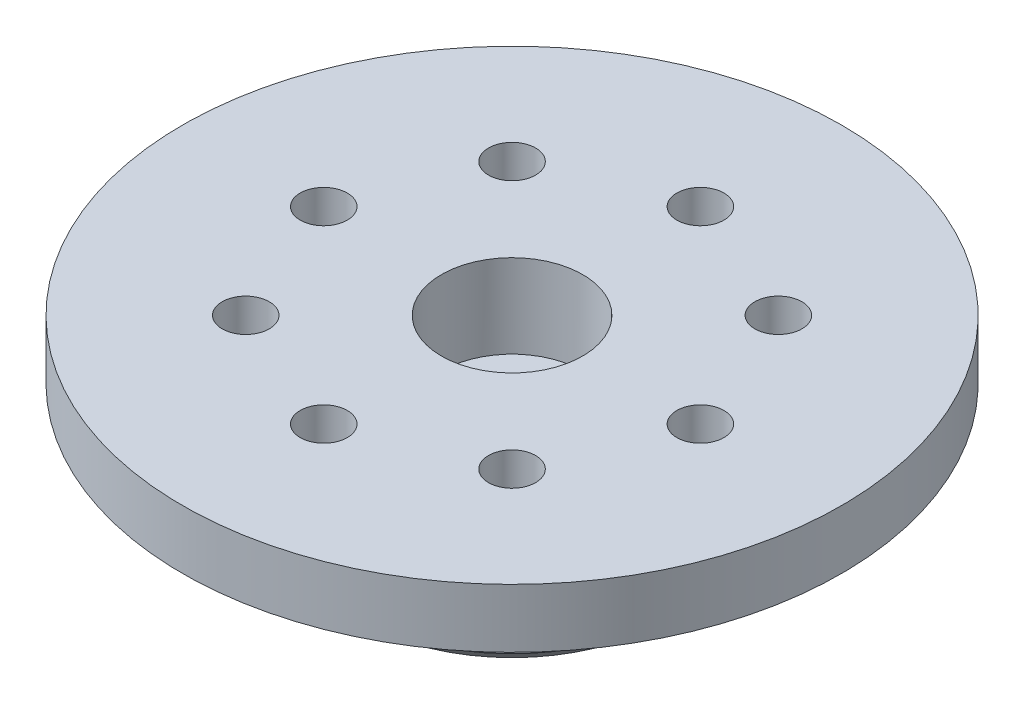
ISO-10303-21;
HEADER;
FILE_DESCRIPTION(('STEP AP214'),'2;1');
FILE_NAME('part.step','',(''),(''),'','','');
FILE_SCHEMA(('AUTOMOTIVE_DESIGN { 1 0 10303 214 1 1 1 1 }'));
ENDSEC;
DATA;
#1=APPLICATION_CONTEXT('core data for automotive mechanical design processes');
#2=APPLICATION_PROTOCOL_DEFINITION('international standard','automotive_design',2000,#1);
#3=PRODUCT_CONTEXT('',#1,'mechanical');
#4=PRODUCT('Part','Part','',(#3));
#5=PRODUCT_RELATED_PRODUCT_CATEGORY('part','',(#4));
#6=PRODUCT_DEFINITION_FORMATION('','',#4);
#7=PRODUCT_DEFINITION_CONTEXT('part definition',#1,'design');
#8=PRODUCT_DEFINITION('design','',#6,#7);
#9=PRODUCT_DEFINITION_SHAPE('','',#8);
#10=(LENGTH_UNIT() NAMED_UNIT(*) SI_UNIT(.MILLI.,.METRE.));
#11=(NAMED_UNIT(*) PLANE_ANGLE_UNIT() SI_UNIT($,.RADIAN.));
#12=(NAMED_UNIT(*) SI_UNIT($,.STERADIAN.) SOLID_ANGLE_UNIT());
#13=UNCERTAINTY_MEASURE_WITH_UNIT(LENGTH_MEASURE(1.E-05),#10,'distance_accuracy_value','');
#14=(GEOMETRIC_REPRESENTATION_CONTEXT(3) GLOBAL_UNCERTAINTY_ASSIGNED_CONTEXT((#13)) GLOBAL_UNIT_ASSIGNED_CONTEXT((#10,
#11,#12)) REPRESENTATION_CONTEXT('',''));
#15=CARTESIAN_POINT('',(0.,0.,0.));
#16=DIRECTION('',(0.,0.,1.));
#17=DIRECTION('',(1.,0.,0.));
#18=AXIS2_PLACEMENT_3D('',#15,#16,#17);
#19=CARTESIAN_POINT('',(0.,-2.5,0.));
#20=DIRECTION('',(0.,-1.,0.));
#21=DIRECTION('',(0.,0.,-1.));
#22=AXIS2_PLACEMENT_3D('',#19,#20,#21);
#23=PLANE('',#22);
#24=CARTESIAN_POINT('',(5.65685424949258,-2.5,-5.65685424949286));
#25=DIRECTION('',(0.,-1.,0.));
#26=DIRECTION('',(0.,0.,-1.));
#27=AXIS2_PLACEMENT_3D('',#24,#25,#26);
#28=CIRCLE('',#27,1.);
#29=CARTESIAN_POINT('',(5.65685424949258,-2.5,-6.65685424949286));
#30=VERTEX_POINT('',#29);
#31=EDGE_CURVE('E76',#30,#30,#28,.T.);
#32=ORIENTED_EDGE('',*,*,#31,.F.);
#33=EDGE_LOOP('',(#32));
#34=FACE_BOUND('',#33,.T.);
#35=CARTESIAN_POINT('',(8.00000000000068,-2.5,-6.81141308890378E-13));
#36=DIRECTION('',(0.,-1.,0.));
#37=DIRECTION('',(0.,0.,-1.));
#38=AXIS2_PLACEMENT_3D('',#35,#36,#37);
#39=CIRCLE('',#38,1.);
#40=CARTESIAN_POINT('',(8.00000000000068,-2.5,-1.00000000000068));
#41=VERTEX_POINT('',#40);
#42=EDGE_CURVE('E72',#41,#41,#39,.T.);
#43=ORIENTED_EDGE('',*,*,#42,.F.);
#44=EDGE_LOOP('',(#43));
#45=FACE_BOUND('',#44,.T.);
#46=CARTESIAN_POINT('',(5.65685424949354,-2.5,5.6568542494919));
#47=DIRECTION('',(0.,-1.,0.));
#48=DIRECTION('',(0.,0.,-1.));
#49=AXIS2_PLACEMENT_3D('',#46,#47,#48);
#50=CIRCLE('',#49,1.);
#51=CARTESIAN_POINT('',(5.65685424949354,-2.5,4.6568542494919));
#52=VERTEX_POINT('',#51);
#53=EDGE_CURVE('E68',#52,#52,#50,.T.);
#54=ORIENTED_EDGE('',*,*,#53,.F.);
#55=EDGE_LOOP('',(#54));
#56=FACE_BOUND('',#55,.T.);
#57=CARTESIAN_POINT('',(1.36228261778076E-12,-2.5,8.));
#58=DIRECTION('',(0.,-1.,0.));
#59=DIRECTION('',(0.,0.,-1.));
#60=AXIS2_PLACEMENT_3D('',#57,#58,#59);
#61=CIRCLE('',#60,1.);
#62=CARTESIAN_POINT('',(1.36228261778076E-12,-2.5,7.));
#63=VERTEX_POINT('',#62);
#64=EDGE_CURVE('E64',#63,#63,#61,.T.);
#65=ORIENTED_EDGE('',*,*,#64,.F.);
#66=EDGE_LOOP('',(#65));
#67=FACE_BOUND('',#66,.T.);
#68=CARTESIAN_POINT('',(-5.65685424949122,-2.5,5.65685424949286));
#69=DIRECTION('',(0.,-1.,0.));
#70=DIRECTION('',(0.,0.,-1.));
#71=AXIS2_PLACEMENT_3D('',#68,#69,#70);
#72=CIRCLE('',#71,1.);
#73=CARTESIAN_POINT('',(-5.65685424949122,-2.5,4.65685424949286));
#74=VERTEX_POINT('',#73);
#75=EDGE_CURVE('E60',#74,#74,#72,.T.);
#76=ORIENTED_EDGE('',*,*,#75,.F.);
#77=EDGE_LOOP('',(#76));
#78=FACE_BOUND('',#77,.T.);
#79=CARTESIAN_POINT('',(-7.99999999999932,-2.5,6.82121026329696E-13));
#80=DIRECTION('',(0.,-1.,0.));
#81=DIRECTION('',(0.,0.,-1.));
#82=AXIS2_PLACEMENT_3D('',#79,#80,#81);
#83=CIRCLE('',#82,1.);
#84=CARTESIAN_POINT('',(-7.99999999999932,-2.5,-0.999999999999318));
#85=VERTEX_POINT('',#84);
#86=EDGE_CURVE('E56',#85,#85,#83,.T.);
#87=ORIENTED_EDGE('',*,*,#86,.F.);
#88=EDGE_LOOP('',(#87));
#89=FACE_BOUND('',#88,.T.);
#90=CARTESIAN_POINT('',(-5.65685424949218,-2.5,-5.6568542494919));
#91=DIRECTION('',(0.,-1.,0.));
#92=DIRECTION('',(0.,0.,-1.));
#93=AXIS2_PLACEMENT_3D('',#90,#91,#92);
#94=CIRCLE('',#93,1.);
#95=CARTESIAN_POINT('',(-5.65685424949218,-2.5,-6.6568542494919));
#96=VERTEX_POINT('',#95);
#97=EDGE_CURVE('E51',#96,#96,#94,.T.);
#98=ORIENTED_EDGE('',*,*,#97,.F.);
#99=EDGE_LOOP('',(#98));
#100=FACE_BOUND('',#99,.T.);
#101=CARTESIAN_POINT('',(0.,-2.5,0.));
#102=DIRECTION('',(0.,-1.,0.));
#103=DIRECTION('',(0.,0.,-1.));
#104=AXIS2_PLACEMENT_3D('',#101,#102,#103);
#105=CIRCLE('',#104,14.);
#106=CARTESIAN_POINT('',(0.,-2.5,-14.));
#107=VERTEX_POINT('',#106);
#108=EDGE_CURVE('E89',#107,#107,#105,.T.);
#109=ORIENTED_EDGE('',*,*,#108,.T.);
#110=EDGE_LOOP('',(#109));
#111=FACE_BOUND('',#110,.T.);
#112=CARTESIAN_POINT('',(0.,-2.5,-8.));
#113=DIRECTION('',(0.,-1.,0.));
#114=DIRECTION('',(0.,0.,-1.));
#115=AXIS2_PLACEMENT_3D('',#112,#113,#114);
#116=CIRCLE('',#115,1.);
#117=CARTESIAN_POINT('',(0.,-2.5,-9.));
#118=VERTEX_POINT('',#117);
#119=EDGE_CURVE('E80',#118,#118,#116,.T.);
#120=ORIENTED_EDGE('',*,*,#119,.F.);
#121=EDGE_LOOP('',(#120));
#122=FACE_BOUND('',#121,.T.);
#123=CARTESIAN_POINT('',(0.,-2.5,0.));
#124=DIRECTION('',(0.,-1.,0.));
#125=DIRECTION('',(0.,0.,-1.));
#126=AXIS2_PLACEMENT_3D('',#123,#124,#125);
#127=CIRCLE('',#126,5.8);
#128=CARTESIAN_POINT('',(0.,-2.5,-5.8));
#129=VERTEX_POINT('',#128);
#130=EDGE_CURVE('E125',#129,#129,#127,.T.);
#131=ORIENTED_EDGE('',*,*,#130,.F.);
#132=EDGE_LOOP('',(#131));
#133=FACE_BOUND('',#132,.T.);
#134=ADVANCED_FACE('F30',(#34,#45,#56,#67,#78,#89,#100,#111,#122,#133),#23,.T.);
#135=CARTESIAN_POINT('',(0.,-5.55,0.));
#136=DIRECTION('',(0.,1.,0.));
#137=DIRECTION('',(0.,0.,1.));
#138=AXIS2_PLACEMENT_3D('',#135,#136,#137);
#139=CYLINDRICAL_SURFACE('',#138,3.);
#140=CARTESIAN_POINT('',(0.,0.,0.));
#141=DIRECTION('',(0.,1.,0.));
#142=DIRECTION('',(0.,0.,1.));
#143=AXIS2_PLACEMENT_3D('',#140,#141,#142);
#144=CIRCLE('',#143,3.);
#145=CARTESIAN_POINT('',(0.,0.,3.));
#146=VERTEX_POINT('',#145);
#147=EDGE_CURVE('E95',#146,#146,#144,.T.);
#148=ORIENTED_EDGE('',*,*,#147,.T.);
#149=EDGE_LOOP('',(#148));
#150=FACE_BOUND('',#149,.T.);
#151=CARTESIAN_POINT('',(0.,-3.55,0.));
#152=DIRECTION('',(0.,-1.,0.));
#153=DIRECTION('',(0.,0.,-1.));
#154=AXIS2_PLACEMENT_3D('',#151,#152,#153);
#155=CIRCLE('',#154,3.);
#156=CARTESIAN_POINT('',(0.,-3.55,-3.));
#157=VERTEX_POINT('',#156);
#158=EDGE_CURVE('E50',#157,#157,#155,.F.);
#159=ORIENTED_EDGE('',*,*,#158,.F.);
#160=EDGE_LOOP('',(#159));
#161=FACE_BOUND('',#160,.T.);
#162=ADVANCED_FACE('F132',(#150,#161),#139,.F.);
#163=CARTESIAN_POINT('',(0.,0.,0.));
#164=DIRECTION('',(0.,-1.,0.));
#165=DIRECTION('',(0.,0.,-1.));
#166=AXIS2_PLACEMENT_3D('',#163,#164,#165);
#167=CYLINDRICAL_SURFACE('',#166,14.);
#168=CARTESIAN_POINT('',(0.,0.,0.));
#169=DIRECTION('',(0.,-1.,0.));
#170=DIRECTION('',(0.,0.,-1.));
#171=AXIS2_PLACEMENT_3D('',#168,#169,#170);
#172=CIRCLE('',#171,14.);
#173=CARTESIAN_POINT('',(0.,0.,-14.));
#174=VERTEX_POINT('',#173);
#175=EDGE_CURVE('E86',#174,#174,#172,.T.);
#176=ORIENTED_EDGE('',*,*,#175,.T.);
#177=EDGE_LOOP('',(#176));
#178=FACE_BOUND('',#177,.T.);
#179=ORIENTED_EDGE('',*,*,#108,.F.);
#180=EDGE_LOOP('',(#179));
#181=FACE_BOUND('',#180,.T.);
#182=ADVANCED_FACE('F138',(#178,#181),#167,.T.);
#183=CARTESIAN_POINT('',(14.,0.,0.));
#184=DIRECTION('',(0.,1.,0.));
#185=DIRECTION('',(0.,0.,1.));
#186=AXIS2_PLACEMENT_3D('',#183,#184,#185);
#187=PLANE('',#186);
#188=CARTESIAN_POINT('',(-5.65685424949218,0.,-5.6568542494919));
#189=DIRECTION('',(0.,1.,0.));
#190=DIRECTION('',(0.,0.,1.));
#191=AXIS2_PLACEMENT_3D('',#188,#189,#190);
#192=CIRCLE('',#191,1.);
#193=CARTESIAN_POINT('',(-5.65685424949218,0.,-4.6568542494919));
#194=VERTEX_POINT('',#193);
#195=EDGE_CURVE('E55',#194,#194,#192,.T.);
#196=ORIENTED_EDGE('',*,*,#195,.F.);
#197=EDGE_LOOP('',(#196));
#198=FACE_BOUND('',#197,.T.);
#199=CARTESIAN_POINT('',(-7.99999999999932,0.,6.82121026329696E-13));
#200=DIRECTION('',(0.,1.,0.));
#201=DIRECTION('',(0.,0.,1.));
#202=AXIS2_PLACEMENT_3D('',#199,#200,#201);
#203=CIRCLE('',#202,1.);
#204=CARTESIAN_POINT('',(-7.99999999999932,0.,1.00000000000068));
#205=VERTEX_POINT('',#204);
#206=EDGE_CURVE('E54',#205,#205,#203,.T.);
#207=ORIENTED_EDGE('',*,*,#206,.F.);
#208=EDGE_LOOP('',(#207));
#209=FACE_BOUND('',#208,.T.);
#210=CARTESIAN_POINT('',(-5.65685424949122,0.,5.65685424949286));
#211=DIRECTION('',(0.,1.,0.));
#212=DIRECTION('',(0.,0.,1.));
#213=AXIS2_PLACEMENT_3D('',#210,#211,#212);
#214=CIRCLE('',#213,1.);
#215=CARTESIAN_POINT('',(-5.65685424949122,0.,6.65685424949286));
#216=VERTEX_POINT('',#215);
#217=EDGE_CURVE('E59',#216,#216,#214,.T.);
#218=ORIENTED_EDGE('',*,*,#217,.F.);
#219=EDGE_LOOP('',(#218));
#220=FACE_BOUND('',#219,.T.);
#221=CARTESIAN_POINT('',(1.36228261778076E-12,0.,8.));
#222=DIRECTION('',(0.,1.,0.));
#223=DIRECTION('',(0.,0.,1.));
#224=AXIS2_PLACEMENT_3D('',#221,#222,#223);
#225=CIRCLE('',#224,1.);
#226=CARTESIAN_POINT('',(1.36228261778076E-12,0.,9.));
#227=VERTEX_POINT('',#226);
#228=EDGE_CURVE('E63',#227,#227,#225,.T.);
#229=ORIENTED_EDGE('',*,*,#228,.F.);
#230=EDGE_LOOP('',(#229));
#231=FACE_BOUND('',#230,.T.);
#232=CARTESIAN_POINT('',(5.65685424949354,0.,5.6568542494919));
#233=DIRECTION('',(0.,1.,0.));
#234=DIRECTION('',(0.,0.,1.));
#235=AXIS2_PLACEMENT_3D('',#232,#233,#234);
#236=CIRCLE('',#235,1.);
#237=CARTESIAN_POINT('',(5.65685424949354,0.,6.6568542494919));
#238=VERTEX_POINT('',#237);
#239=EDGE_CURVE('E67',#238,#238,#236,.T.);
#240=ORIENTED_EDGE('',*,*,#239,.F.);
#241=EDGE_LOOP('',(#240));
#242=FACE_BOUND('',#241,.T.);
#243=CARTESIAN_POINT('',(8.00000000000068,0.,-6.81141308890378E-13));
#244=DIRECTION('',(0.,1.,0.));
#245=DIRECTION('',(0.,0.,1.));
#246=AXIS2_PLACEMENT_3D('',#243,#244,#245);
#247=CIRCLE('',#246,1.);
#248=CARTESIAN_POINT('',(8.00000000000068,0.,0.99999999999932));
#249=VERTEX_POINT('',#248);
#250=EDGE_CURVE('E71',#249,#249,#247,.T.);
#251=ORIENTED_EDGE('',*,*,#250,.F.);
#252=EDGE_LOOP('',(#251));
#253=FACE_BOUND('',#252,.T.);
#254=CARTESIAN_POINT('',(5.65685424949258,0.,-5.65685424949286));
#255=DIRECTION('',(0.,1.,0.));
#256=DIRECTION('',(0.,0.,1.));
#257=AXIS2_PLACEMENT_3D('',#254,#255,#256);
#258=CIRCLE('',#257,1.);
#259=CARTESIAN_POINT('',(5.65685424949258,0.,-4.65685424949286));
#260=VERTEX_POINT('',#259);
#261=EDGE_CURVE('E75',#260,#260,#258,.T.);
#262=ORIENTED_EDGE('',*,*,#261,.F.);
#263=EDGE_LOOP('',(#262));
#264=FACE_BOUND('',#263,.T.);
#265=CARTESIAN_POINT('',(0.,0.,-8.));
#266=DIRECTION('',(0.,1.,0.));
#267=DIRECTION('',(0.,0.,1.));
#268=AXIS2_PLACEMENT_3D('',#265,#266,#267);
#269=CIRCLE('',#268,1.);
#270=CARTESIAN_POINT('',(0.,0.,-7.));
#271=VERTEX_POINT('',#270);
#272=EDGE_CURVE('E79',#271,#271,#269,.T.);
#273=ORIENTED_EDGE('',*,*,#272,.F.);
#274=EDGE_LOOP('',(#273));
#275=FACE_BOUND('',#274,.T.);
#276=ORIENTED_EDGE('',*,*,#175,.F.);
#277=EDGE_LOOP('',(#276));
#278=FACE_BOUND('',#277,.T.);
#279=ORIENTED_EDGE('',*,*,#147,.F.);
#280=EDGE_LOOP('',(#279));
#281=FACE_BOUND('',#280,.T.);
#282=ADVANCED_FACE('F146',(#198,#209,#220,#231,#242,#253,#264,#275,#278,#281),#187,.T.);
#283=CARTESIAN_POINT('',(0.,-5.55,0.));
#284=DIRECTION('',(0.,1.,0.));
#285=DIRECTION('',(0.,0.,1.));
#286=AXIS2_PLACEMENT_3D('',#283,#284,#285);
#287=PLANE('',#286);
#288=CARTESIAN_POINT('',(0.,-5.55,0.));
#289=DIRECTION('',(0.,1.,0.));
#290=DIRECTION('',(0.,0.,1.));
#291=AXIS2_PLACEMENT_3D('',#288,#289,#290);
#292=CIRCLE('',#291,5.5);
#293=CARTESIAN_POINT('',(0.,-5.55,5.5));
#294=VERTEX_POINT('',#293);
#295=EDGE_CURVE('E92',#294,#294,#292,.T.);
#296=ORIENTED_EDGE('',*,*,#295,.F.);
#297=EDGE_LOOP('',(#296));
#298=FACE_BOUND('',#297,.T.);
#299=CARTESIAN_POINT('',(0.,-5.55,0.));
#300=DIRECTION('',(0.,-1.,0.));
#301=DIRECTION('',(0.,0.,-1.));
#302=AXIS2_PLACEMENT_3D('',#299,#300,#301);
#303=CIRCLE('',#302,1.);
#304=CARTESIAN_POINT('',(0.,-5.55,-1.));
#305=VERTEX_POINT('',#304);
#306=EDGE_CURVE('E83',#305,#305,#303,.T.);
#307=ORIENTED_EDGE('',*,*,#306,.F.);
#308=EDGE_LOOP('',(#307));
#309=FACE_BOUND('',#308,.T.);
#310=ADVANCED_FACE('F145',(#298,#309),#287,.F.);
#311=CARTESIAN_POINT('',(0.,-3.55,0.));
#312=DIRECTION('',(0.,-1.,0.));
#313=DIRECTION('',(0.,0.,-1.));
#314=AXIS2_PLACEMENT_3D('',#311,#312,#313);
#315=PLANE('',#314);
#316=CARTESIAN_POINT('',(0.,-3.55,0.));
#317=DIRECTION('',(0.,-1.,0.));
#318=DIRECTION('',(0.,0.,-1.));
#319=AXIS2_PLACEMENT_3D('',#316,#317,#318);
#320=CIRCLE('',#319,1.);
#321=CARTESIAN_POINT('',(0.,-3.55,-1.));
#322=VERTEX_POINT('',#321);
#323=EDGE_CURVE('E98',#322,#322,#320,.T.);
#324=ORIENTED_EDGE('',*,*,#323,.T.);
#325=EDGE_LOOP('',(#324));
#326=FACE_BOUND('',#325,.T.);
#327=ORIENTED_EDGE('',*,*,#158,.T.);
#328=EDGE_LOOP('',(#327));
#329=FACE_BOUND('',#328,.T.);
#330=ADVANCED_FACE('F183',(#326,#329),#315,.F.);
#331=CARTESIAN_POINT('',(0.,-3.55,0.));
#332=DIRECTION('',(0.,-1.,0.));
#333=DIRECTION('',(0.,0.,-1.));
#334=AXIS2_PLACEMENT_3D('',#331,#332,#333);
#335=CYLINDRICAL_SURFACE('',#334,1.);
#336=ORIENTED_EDGE('',*,*,#323,.F.);
#337=EDGE_LOOP('',(#336));
#338=FACE_BOUND('',#337,.T.);
#339=ORIENTED_EDGE('',*,*,#306,.T.);
#340=EDGE_LOOP('',(#339));
#341=FACE_BOUND('',#340,.T.);
#342=ADVANCED_FACE('F186',(#338,#341),#335,.F.);
#343=CARTESIAN_POINT('',(0.,-10.,-8.));
#344=DIRECTION('',(0.,1.,0.));
#345=DIRECTION('',(0.,0.,1.));
#346=AXIS2_PLACEMENT_3D('',#343,#344,#345);
#347=CYLINDRICAL_SURFACE('',#346,1.);
#348=ORIENTED_EDGE('',*,*,#119,.T.);
#349=EDGE_LOOP('',(#348));
#350=FACE_BOUND('',#349,.T.);
#351=ORIENTED_EDGE('',*,*,#272,.T.);
#352=EDGE_LOOP('',(#351));
#353=FACE_BOUND('',#352,.T.);
#354=ADVANCED_FACE('F188',(#350,#353),#347,.F.);
#355=CARTESIAN_POINT('',(5.65685424949258,-10.,-5.65685424949286));
#356=DIRECTION('',(0.,1.,0.));
#357=DIRECTION('',(0.,0.,1.));
#358=AXIS2_PLACEMENT_3D('',#355,#356,#357);
#359=CYLINDRICAL_SURFACE('',#358,1.);
#360=ORIENTED_EDGE('',*,*,#31,.T.);
#361=EDGE_LOOP('',(#360));
#362=FACE_BOUND('',#361,.T.);
#363=ORIENTED_EDGE('',*,*,#261,.T.);
#364=EDGE_LOOP('',(#363));
#365=FACE_BOUND('',#364,.T.);
#366=ADVANCED_FACE('F195',(#362,#365),#359,.F.);
#367=CARTESIAN_POINT('',(8.00000000000068,-10.,-6.81141308890378E-13));
#368=DIRECTION('',(0.,1.,0.));
#369=DIRECTION('',(0.,0.,1.));
#370=AXIS2_PLACEMENT_3D('',#367,#368,#369);
#371=CYLINDRICAL_SURFACE('',#370,1.);
#372=ORIENTED_EDGE('',*,*,#42,.T.);
#373=EDGE_LOOP('',(#372));
#374=FACE_BOUND('',#373,.T.);
#375=ORIENTED_EDGE('',*,*,#250,.T.);
#376=EDGE_LOOP('',(#375));
#377=FACE_BOUND('',#376,.T.);
#378=ADVANCED_FACE('F204',(#374,#377),#371,.F.);
#379=CARTESIAN_POINT('',(5.65685424949354,-10.,5.6568542494919));
#380=DIRECTION('',(0.,1.,0.));
#381=DIRECTION('',(0.,0.,1.));
#382=AXIS2_PLACEMENT_3D('',#379,#380,#381);
#383=CYLINDRICAL_SURFACE('',#382,1.);
#384=ORIENTED_EDGE('',*,*,#53,.T.);
#385=EDGE_LOOP('',(#384));
#386=FACE_BOUND('',#385,.T.);
#387=ORIENTED_EDGE('',*,*,#239,.T.);
#388=EDGE_LOOP('',(#387));
#389=FACE_BOUND('',#388,.T.);
#390=ADVANCED_FACE('F208',(#386,#389),#383,.F.);
#391=CARTESIAN_POINT('',(1.36228261778076E-12,-10.,8.));
#392=DIRECTION('',(0.,1.,0.));
#393=DIRECTION('',(0.,0.,1.));
#394=AXIS2_PLACEMENT_3D('',#391,#392,#393);
#395=CYLINDRICAL_SURFACE('',#394,1.);
#396=ORIENTED_EDGE('',*,*,#64,.T.);
#397=EDGE_LOOP('',(#396));
#398=FACE_BOUND('',#397,.T.);
#399=ORIENTED_EDGE('',*,*,#228,.T.);
#400=EDGE_LOOP('',(#399));
#401=FACE_BOUND('',#400,.T.);
#402=ADVANCED_FACE('F212',(#398,#401),#395,.F.);
#403=CARTESIAN_POINT('',(-5.65685424949122,-10.,5.65685424949286));
#404=DIRECTION('',(0.,1.,0.));
#405=DIRECTION('',(0.,0.,1.));
#406=AXIS2_PLACEMENT_3D('',#403,#404,#405);
#407=CYLINDRICAL_SURFACE('',#406,1.);
#408=ORIENTED_EDGE('',*,*,#75,.T.);
#409=EDGE_LOOP('',(#408));
#410=FACE_BOUND('',#409,.T.);
#411=ORIENTED_EDGE('',*,*,#217,.T.);
#412=EDGE_LOOP('',(#411));
#413=FACE_BOUND('',#412,.T.);
#414=ADVANCED_FACE('F216',(#410,#413),#407,.F.);
#415=CARTESIAN_POINT('',(-7.99999999999932,-10.,6.82121026329696E-13));
#416=DIRECTION('',(0.,1.,0.));
#417=DIRECTION('',(0.,0.,1.));
#418=AXIS2_PLACEMENT_3D('',#415,#416,#417);
#419=CYLINDRICAL_SURFACE('',#418,1.);
#420=ORIENTED_EDGE('',*,*,#86,.T.);
#421=EDGE_LOOP('',(#420));
#422=FACE_BOUND('',#421,.T.);
#423=ORIENTED_EDGE('',*,*,#206,.T.);
#424=EDGE_LOOP('',(#423));
#425=FACE_BOUND('',#424,.T.);
#426=ADVANCED_FACE('F220',(#422,#425),#419,.F.);
#427=CARTESIAN_POINT('',(-5.65685424949218,-10.,-5.6568542494919));
#428=DIRECTION('',(0.,1.,0.));
#429=DIRECTION('',(0.,0.,1.));
#430=AXIS2_PLACEMENT_3D('',#427,#428,#429);
#431=CYLINDRICAL_SURFACE('',#430,1.);
#432=ORIENTED_EDGE('',*,*,#97,.T.);
#433=EDGE_LOOP('',(#432));
#434=FACE_BOUND('',#433,.T.);
#435=ORIENTED_EDGE('',*,*,#195,.T.);
#436=EDGE_LOOP('',(#435));
#437=FACE_BOUND('',#436,.T.);
#438=ADVANCED_FACE('F177',(#434,#437),#431,.F.);
#439=CARTESIAN_POINT('',(0.,-8.,0.));
#440=DIRECTION('',(0.,1.,0.));
#441=DIRECTION('',(0.,0.,1.));
#442=AXIS2_PLACEMENT_3D('',#439,#440,#441);
#443=CYLINDRICAL_SURFACE('',#442,5.5);
#444=CARTESIAN_POINT('',(0.,-8.,0.));
#445=DIRECTION('',(0.,-1.,0.));
#446=DIRECTION('',(0.,0.,-1.));
#447=AXIS2_PLACEMENT_3D('',#444,#445,#446);
#448=CIRCLE('',#447,5.5);
#449=CARTESIAN_POINT('',(0.,-8.,-5.5));
#450=VERTEX_POINT('',#449);
#451=EDGE_CURVE('E119',#450,#450,#448,.T.);
#452=ORIENTED_EDGE('',*,*,#451,.T.);
#453=EDGE_LOOP('',(#452));
#454=FACE_BOUND('',#453,.T.);
#455=ORIENTED_EDGE('',*,*,#295,.T.);
#456=EDGE_LOOP('',(#455));
#457=FACE_BOUND('',#456,.T.);
#458=ADVANCED_FACE('F171',(#454,#457),#443,.F.);
#459=CARTESIAN_POINT('',(0.,-8.,0.));
#460=DIRECTION('',(0.,-1.,0.));
#461=DIRECTION('',(0.,0.,-1.));
#462=AXIS2_PLACEMENT_3D('',#459,#460,#461);
#463=PLANE('',#462);
#464=CARTESIAN_POINT('',(0.,-8.,0.));
#465=DIRECTION('',(0.,-1.,0.));
#466=DIRECTION('',(0.,0.,-1.));
#467=AXIS2_PLACEMENT_3D('',#464,#465,#466);
#468=CIRCLE('',#467,6.5);
#469=CARTESIAN_POINT('',(0.,-8.,-6.5));
#470=VERTEX_POINT('',#469);
#471=EDGE_CURVE('E45',#470,#470,#468,.T.);
#472=ORIENTED_EDGE('',*,*,#471,.T.);
#473=EDGE_LOOP('',(#472));
#474=FACE_BOUND('',#473,.T.);
#475=ORIENTED_EDGE('',*,*,#451,.F.);
#476=EDGE_LOOP('',(#475));
#477=FACE_BOUND('',#476,.T.);
#478=ADVANCED_FACE('F162',(#474,#477),#463,.T.);
#479=CARTESIAN_POINT('',(0.,-8.,0.));
#480=DIRECTION('',(0.,1.,0.));
#481=DIRECTION('',(0.,0.,1.));
#482=AXIS2_PLACEMENT_3D('',#479,#480,#481);
#483=CYLINDRICAL_SURFACE('',#482,7.);
#484=CARTESIAN_POINT('',(0.,-4.5,0.));
#485=DIRECTION('',(0.,-1.,0.));
#486=DIRECTION('',(0.,0.,-1.));
#487=AXIS2_PLACEMENT_3D('',#484,#485,#486);
#488=CIRCLE('',#487,7.);
#489=CARTESIAN_POINT('',(0.,-4.5,-7.));
#490=VERTEX_POINT('',#489);
#491=EDGE_CURVE('E122',#490,#490,#488,.T.);
#492=ORIENTED_EDGE('',*,*,#491,.T.);
#493=EDGE_LOOP('',(#492));
#494=FACE_BOUND('',#493,.T.);
#495=CARTESIAN_POINT('',(0.,-7.50000000000001,0.));
#496=DIRECTION('',(0.,-1.,0.));
#497=DIRECTION('',(0.,0.,-1.));
#498=AXIS2_PLACEMENT_3D('',#495,#496,#497);
#499=CIRCLE('',#498,7.);
#500=CARTESIAN_POINT('',(0.,-7.50000000000001,-7.));
#501=VERTEX_POINT('',#500);
#502=EDGE_CURVE('E41',#501,#501,#499,.F.);
#503=ORIENTED_EDGE('',*,*,#502,.T.);
#504=EDGE_LOOP('',(#503));
#505=FACE_BOUND('',#504,.T.);
#506=ADVANCED_FACE('F155',(#494,#505),#483,.T.);
#507=CARTESIAN_POINT('',(0.,-8.,0.));
#508=DIRECTION('',(0.,1.,0.));
#509=DIRECTION('',(0.,0.,1.));
#510=AXIS2_PLACEMENT_3D('',#507,#508,#509);
#511=CONICAL_SURFACE('',#510,6.5,0.785398163397451);
#512=ORIENTED_EDGE('',*,*,#502,.F.);
#513=EDGE_LOOP('',(#512));
#514=FACE_BOUND('',#513,.T.);
#515=ORIENTED_EDGE('',*,*,#471,.F.);
#516=EDGE_LOOP('',(#515));
#517=FACE_BOUND('',#516,.T.);
#518=ADVANCED_FACE('F152',(#514,#517),#511,.T.);
#519=CARTESIAN_POINT('',(0.,-4.5,0.));
#520=DIRECTION('',(0.,-1.,0.));
#521=DIRECTION('',(0.,0.,-1.));
#522=AXIS2_PLACEMENT_3D('',#519,#520,#521);
#523=PLANE('',#522);
#524=CARTESIAN_POINT('',(0.,-4.5,0.));
#525=DIRECTION('',(0.,-1.,0.));
#526=DIRECTION('',(0.,0.,-1.));
#527=AXIS2_PLACEMENT_3D('',#524,#525,#526);
#528=CIRCLE('',#527,6.8);
#529=CARTESIAN_POINT('',(0.,-4.5,-6.8));
#530=VERTEX_POINT('',#529);
#531=EDGE_CURVE('E37',#530,#530,#528,.T.);
#532=ORIENTED_EDGE('',*,*,#531,.T.);
#533=EDGE_LOOP('',(#532));
#534=FACE_BOUND('',#533,.T.);
#535=ORIENTED_EDGE('',*,*,#491,.F.);
#536=EDGE_LOOP('',(#535));
#537=FACE_BOUND('',#536,.T.);
#538=ADVANCED_FACE('F154',(#534,#537),#523,.F.);
#539=CARTESIAN_POINT('',(0.,-4.5,0.));
#540=DIRECTION('',(0.,1.,0.));
#541=DIRECTION('',(0.,0.,1.));
#542=AXIS2_PLACEMENT_3D('',#539,#540,#541);
#543=CYLINDRICAL_SURFACE('',#542,5.8);
#544=CARTESIAN_POINT('',(0.,-3.50000000000001,0.));
#545=DIRECTION('',(0.,-1.,0.));
#546=DIRECTION('',(0.,0.,-1.));
#547=AXIS2_PLACEMENT_3D('',#544,#545,#546);
#548=CIRCLE('',#547,5.8);
#549=CARTESIAN_POINT('',(0.,-3.50000000000001,-5.8));
#550=VERTEX_POINT('',#549);
#551=EDGE_CURVE('E10',#550,#550,#548,.F.);
#552=ORIENTED_EDGE('',*,*,#551,.T.);
#553=EDGE_LOOP('',(#552));
#554=FACE_BOUND('',#553,.T.);
#555=ORIENTED_EDGE('',*,*,#130,.T.);
#556=EDGE_LOOP('',(#555));
#557=FACE_BOUND('',#556,.T.);
#558=ADVANCED_FACE('F129',(#554,#557),#543,.T.);
#559=CARTESIAN_POINT('',(0.,-4.5,0.));
#560=DIRECTION('',(0.,-1.,0.));
#561=DIRECTION('',(0.,0.,-1.));
#562=AXIS2_PLACEMENT_3D('',#559,#560,#561);
#563=CONICAL_SURFACE('',#562,6.8,0.785398163397453);
#564=ORIENTED_EDGE('',*,*,#551,.F.);
#565=EDGE_LOOP('',(#564));
#566=FACE_BOUND('',#565,.T.);
#567=ORIENTED_EDGE('',*,*,#531,.F.);
#568=EDGE_LOOP('',(#567));
#569=FACE_BOUND('',#568,.T.);
#570=ADVANCED_FACE('F32',(#566,#569),#563,.T.);
#571=CLOSED_SHELL('',(#134,#162,#182,#282,#310,#330,#342,#354,#366,#378,#390,#402,#414,#426,
#438,#458,#478,#506,#518,#538,#558,#570));
#572=MANIFOLD_SOLID_BREP('B2',#571);
#573=ADVANCED_BREP_SHAPE_REPRESENTATION('',(#18,#572),#14);
#574=SHAPE_DEFINITION_REPRESENTATION(#9,#573);
ENDSEC;
END-ISO-10303-21;
